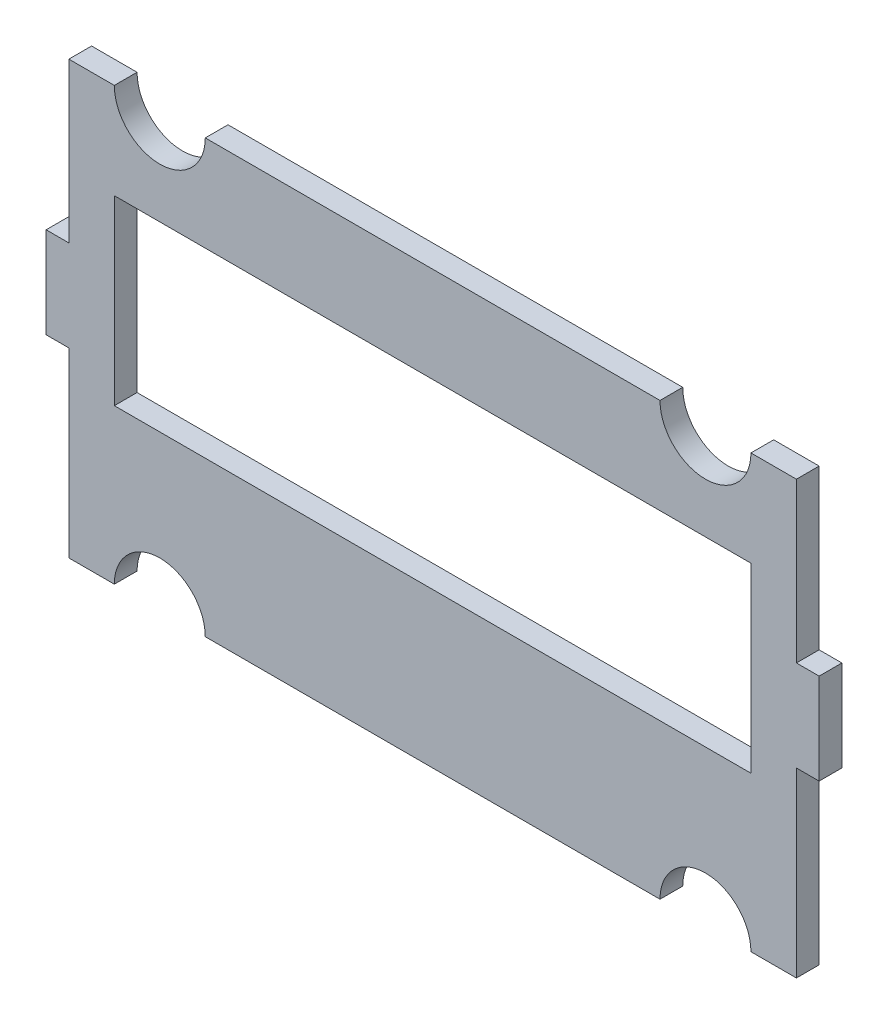
ISO-10303-21;
HEADER;
FILE_DESCRIPTION(('STEP AP214'),'2;1');
FILE_NAME('part.step','',(''),(''),'','','');
FILE_SCHEMA(('AUTOMOTIVE_DESIGN { 1 0 10303 214 1 1 1 1 }'));
ENDSEC;
DATA;
#1=APPLICATION_CONTEXT('core data for automotive mechanical design processes');
#2=APPLICATION_PROTOCOL_DEFINITION('international standard','automotive_design',2000,#1);
#3=PRODUCT_CONTEXT('',#1,'mechanical');
#4=PRODUCT('Part','Part','',(#3));
#5=PRODUCT_RELATED_PRODUCT_CATEGORY('part','',(#4));
#6=PRODUCT_DEFINITION_FORMATION('','',#4);
#7=PRODUCT_DEFINITION_CONTEXT('part definition',#1,'design');
#8=PRODUCT_DEFINITION('design','',#6,#7);
#9=PRODUCT_DEFINITION_SHAPE('','',#8);
#10=(LENGTH_UNIT() NAMED_UNIT(*) SI_UNIT(.MILLI.,.METRE.));
#11=(NAMED_UNIT(*) PLANE_ANGLE_UNIT() SI_UNIT($,.RADIAN.));
#12=(NAMED_UNIT(*) SI_UNIT($,.STERADIAN.) SOLID_ANGLE_UNIT());
#13=UNCERTAINTY_MEASURE_WITH_UNIT(LENGTH_MEASURE(1.E-05),#10,'distance_accuracy_value','');
#14=(GEOMETRIC_REPRESENTATION_CONTEXT(3) GLOBAL_UNCERTAINTY_ASSIGNED_CONTEXT((#13)) GLOBAL_UNIT_ASSIGNED_CONTEXT((#10,
#11,#12)) REPRESENTATION_CONTEXT('',''));
#15=CARTESIAN_POINT('',(0.,0.,0.));
#16=DIRECTION('',(0.,0.,1.));
#17=DIRECTION('',(1.,0.,0.));
#18=AXIS2_PLACEMENT_3D('',#15,#16,#17);
#19=CARTESIAN_POINT('',(0.,0.,3.175));
#20=DIRECTION('',(0.,1.,0.));
#21=DIRECTION('',(0.,0.,1.));
#22=AXIS2_PLACEMENT_3D('',#19,#20,#21);
#23=PLANE('',#22);
#24=DIRECTION('',(1.,0.,0.));
#25=VECTOR('',#24,1.);
#26=CARTESIAN_POINT('',(0.,0.,0.));
#27=LINE('',#26,#25);
#28=CARTESIAN_POINT('',(19.05,0.,0.));
#29=VERTEX_POINT('',#28);
#30=CARTESIAN_POINT('',(82.55,0.,0.));
#31=VERTEX_POINT('',#30);
#32=EDGE_CURVE('E393',#29,#31,#27,.T.);
#33=ORIENTED_EDGE('',*,*,#32,.T.);
#34=DIRECTION('',(0.,0.,1.));
#35=VECTOR('',#34,1.);
#36=CARTESIAN_POINT('',(82.55,0.,0.));
#37=LINE('',#36,#35);
#38=CARTESIAN_POINT('',(82.55,0.,3.175));
#39=VERTEX_POINT('',#38);
#40=EDGE_CURVE('E55',#31,#39,#37,.T.);
#41=ORIENTED_EDGE('',*,*,#40,.T.);
#42=DIRECTION('',(1.,0.,0.));
#43=VECTOR('',#42,1.);
#44=CARTESIAN_POINT('',(0.,0.,3.175));
#45=LINE('',#44,#43);
#46=CARTESIAN_POINT('',(19.05,0.,3.175));
#47=VERTEX_POINT('',#46);
#48=EDGE_CURVE('E379',#47,#39,#45,.T.);
#49=ORIENTED_EDGE('',*,*,#48,.F.);
#50=DIRECTION('',(0.,0.,1.));
#51=VECTOR('',#50,1.);
#52=CARTESIAN_POINT('',(19.05,0.,0.));
#53=LINE('',#52,#51);
#54=EDGE_CURVE('E425',#29,#47,#53,.T.);
#55=ORIENTED_EDGE('',*,*,#54,.F.);
#56=EDGE_LOOP('',(#33,#41,#49,#55));
#57=FACE_BOUND('',#56,.T.);
#58=ADVANCED_FACE('F39',(#57),#23,.F.);
#59=CARTESIAN_POINT('',(0.,0.,0.));
#60=VERTEX_POINT('',#59);
#61=CARTESIAN_POINT('',(6.35,0.,0.));
#62=VERTEX_POINT('',#61);
#63=EDGE_CURVE('E388',#60,#62,#27,.T.);
#64=ORIENTED_EDGE('',*,*,#63,.T.);
#65=DIRECTION('',(0.,0.,1.));
#66=VECTOR('',#65,1.);
#67=CARTESIAN_POINT('',(6.35,0.,0.));
#68=LINE('',#67,#66);
#69=CARTESIAN_POINT('',(6.35,0.,3.175));
#70=VERTEX_POINT('',#69);
#71=EDGE_CURVE('E63',#62,#70,#68,.T.);
#72=ORIENTED_EDGE('',*,*,#71,.T.);
#73=CARTESIAN_POINT('',(0.,0.,3.175));
#74=VERTEX_POINT('',#73);
#75=EDGE_CURVE('E374',#74,#70,#45,.T.);
#76=ORIENTED_EDGE('',*,*,#75,.F.);
#77=DIRECTION('',(0.,0.,-1.));
#78=VECTOR('',#77,1.);
#79=CARTESIAN_POINT('',(0.,0.,3.175));
#80=LINE('',#79,#78);
#81=EDGE_CURVE('E11',#74,#60,#80,.T.);
#82=ORIENTED_EDGE('',*,*,#81,.T.);
#83=EDGE_LOOP('',(#64,#72,#76,#82));
#84=FACE_BOUND('',#83,.T.);
#85=ADVANCED_FACE('F459',(#84),#23,.F.);
#86=CARTESIAN_POINT('',(0.,60.325,0.));
#87=DIRECTION('',(0.,-1.,0.));
#88=DIRECTION('',(0.,0.,-1.));
#89=AXIS2_PLACEMENT_3D('',#86,#87,#88);
#90=PLANE('',#89);
#91=DIRECTION('',(1.,0.,0.));
#92=VECTOR('',#91,1.);
#93=CARTESIAN_POINT('',(0.,60.325,0.));
#94=LINE('',#93,#92);
#95=CARTESIAN_POINT('',(19.05,60.325,0.));
#96=VERTEX_POINT('',#95);
#97=CARTESIAN_POINT('',(82.55,60.325,0.));
#98=VERTEX_POINT('',#97);
#99=EDGE_CURVE('E222',#96,#98,#94,.T.);
#100=ORIENTED_EDGE('',*,*,#99,.F.);
#101=DIRECTION('',(0.,0.,1.));
#102=VECTOR('',#101,1.);
#103=CARTESIAN_POINT('',(19.05,60.325,0.));
#104=LINE('',#103,#102);
#105=CARTESIAN_POINT('',(19.05,60.325,3.175));
#106=VERTEX_POINT('',#105);
#107=EDGE_CURVE('E440',#96,#106,#104,.T.);
#108=ORIENTED_EDGE('',*,*,#107,.T.);
#109=DIRECTION('',(1.,0.,0.));
#110=VECTOR('',#109,1.);
#111=CARTESIAN_POINT('',(0.,60.325,3.175));
#112=LINE('',#111,#110);
#113=CARTESIAN_POINT('',(82.55,60.325,3.175));
#114=VERTEX_POINT('',#113);
#115=EDGE_CURVE('E236',#106,#114,#112,.T.);
#116=ORIENTED_EDGE('',*,*,#115,.T.);
#117=DIRECTION('',(0.,0.,1.));
#118=VECTOR('',#117,1.);
#119=CARTESIAN_POINT('',(82.55,60.325,0.));
#120=LINE('',#119,#118);
#121=EDGE_CURVE('E211',#98,#114,#120,.T.);
#122=ORIENTED_EDGE('',*,*,#121,.F.);
#123=EDGE_LOOP('',(#100,#108,#116,#122));
#124=FACE_BOUND('',#123,.T.);
#125=ADVANCED_FACE('F491',(#124),#90,.F.);
#126=CARTESIAN_POINT('',(95.25,60.325,0.));
#127=VERTEX_POINT('',#126);
#128=CARTESIAN_POINT('',(101.6,60.325,0.));
#129=VERTEX_POINT('',#128);
#130=EDGE_CURVE('E218',#127,#129,#94,.T.);
#131=ORIENTED_EDGE('',*,*,#130,.F.);
#132=DIRECTION('',(0.,0.,1.));
#133=VECTOR('',#132,1.);
#134=CARTESIAN_POINT('',(95.25,60.325,0.));
#135=LINE('',#134,#133);
#136=CARTESIAN_POINT('',(95.25,60.325,3.175));
#137=VERTEX_POINT('',#136);
#138=EDGE_CURVE('E200',#127,#137,#135,.T.);
#139=ORIENTED_EDGE('',*,*,#138,.T.);
#140=CARTESIAN_POINT('',(101.6,60.325,3.175));
#141=VERTEX_POINT('',#140);
#142=EDGE_CURVE('E238',#137,#141,#112,.T.);
#143=ORIENTED_EDGE('',*,*,#142,.T.);
#144=DIRECTION('',(0.,0.,1.));
#145=VECTOR('',#144,1.);
#146=CARTESIAN_POINT('',(101.6,60.325,0.));
#147=LINE('',#146,#145);
#148=EDGE_CURVE('E227',#129,#141,#147,.T.);
#149=ORIENTED_EDGE('',*,*,#148,.F.);
#150=EDGE_LOOP('',(#131,#139,#143,#149));
#151=FACE_BOUND('',#150,.T.);
#152=ADVANCED_FACE('F225',(#151),#90,.F.);
#153=CARTESIAN_POINT('',(101.6,0.,3.175));
#154=DIRECTION('',(-1.,0.,0.));
#155=DIRECTION('',(0.,-1.,0.));
#156=AXIS2_PLACEMENT_3D('',#153,#154,#155);
#157=PLANE('',#156);
#158=DIRECTION('',(0.,1.,0.));
#159=VECTOR('',#158,1.);
#160=CARTESIAN_POINT('',(101.6,0.,0.));
#161=LINE('',#160,#159);
#162=CARTESIAN_POINT('',(101.6,38.1,0.));
#163=VERTEX_POINT('',#162);
#164=EDGE_CURVE('E392',#163,#129,#161,.T.);
#165=ORIENTED_EDGE('',*,*,#164,.T.);
#166=ORIENTED_EDGE('',*,*,#148,.T.);
#167=DIRECTION('',(0.,1.,0.));
#168=VECTOR('',#167,1.);
#169=CARTESIAN_POINT('',(101.6,0.,3.175));
#170=LINE('',#169,#168);
#171=CARTESIAN_POINT('',(101.6,38.1,3.175));
#172=VERTEX_POINT('',#171);
#173=EDGE_CURVE('E378',#172,#141,#170,.T.);
#174=ORIENTED_EDGE('',*,*,#173,.F.);
#175=DIRECTION('',(0.,0.,1.));
#176=VECTOR('',#175,1.);
#177=CARTESIAN_POINT('',(101.6,38.1,-13.0908603613361));
#178=LINE('',#177,#176);
#179=EDGE_CURVE('E272',#163,#172,#178,.T.);
#180=ORIENTED_EDGE('',*,*,#179,.F.);
#181=EDGE_LOOP('',(#165,#166,#174,#180));
#182=FACE_BOUND('',#181,.T.);
#183=ADVANCED_FACE('F498',(#182),#157,.F.);
#184=CARTESIAN_POINT('',(0.,0.,3.175));
#185=DIRECTION('',(1.,0.,0.));
#186=DIRECTION('',(0.,0.,-1.));
#187=AXIS2_PLACEMENT_3D('',#184,#185,#186);
#188=PLANE('',#187);
#189=DIRECTION('',(0.,0.,1.));
#190=VECTOR('',#189,1.);
#191=CARTESIAN_POINT('',(0.,25.4,-13.0908603613361));
#192=LINE('',#191,#190);
#193=CARTESIAN_POINT('',(0.,25.4,0.));
#194=VERTEX_POINT('',#193);
#195=CARTESIAN_POINT('',(0.,25.4,3.175));
#196=VERTEX_POINT('',#195);
#197=EDGE_CURVE('E308',#194,#196,#192,.T.);
#198=ORIENTED_EDGE('',*,*,#197,.F.);
#199=DIRECTION('',(0.,-1.,0.));
#200=VECTOR('',#199,1.);
#201=CARTESIAN_POINT('',(0.,0.,0.));
#202=LINE('',#201,#200);
#203=EDGE_CURVE('E359',#194,#60,#202,.T.);
#204=ORIENTED_EDGE('',*,*,#203,.T.);
#205=ORIENTED_EDGE('',*,*,#81,.F.);
#206=DIRECTION('',(0.,-1.,0.));
#207=VECTOR('',#206,1.);
#208=CARTESIAN_POINT('',(0.,0.,3.175));
#209=LINE('',#208,#207);
#210=EDGE_CURVE('E373',#196,#74,#209,.T.);
#211=ORIENTED_EDGE('',*,*,#210,.F.);
#212=EDGE_LOOP('',(#198,#204,#205,#211));
#213=FACE_BOUND('',#212,.T.);
#214=ADVANCED_FACE('F472',(#213),#188,.F.);
#215=CARTESIAN_POINT('',(0.,60.325,3.175));
#216=VERTEX_POINT('',#215);
#217=CARTESIAN_POINT('',(0.,38.1,3.175));
#218=VERTEX_POINT('',#217);
#219=EDGE_CURVE('E369',#216,#218,#209,.T.);
#220=ORIENTED_EDGE('',*,*,#219,.F.);
#221=DIRECTION('',(0.,0.,1.));
#222=VECTOR('',#221,1.);
#223=CARTESIAN_POINT('',(0.,60.325,0.));
#224=LINE('',#223,#222);
#225=CARTESIAN_POINT('',(0.,60.325,0.));
#226=VERTEX_POINT('',#225);
#227=EDGE_CURVE('E242',#226,#216,#224,.T.);
#228=ORIENTED_EDGE('',*,*,#227,.F.);
#229=CARTESIAN_POINT('',(0.,38.1,0.));
#230=VERTEX_POINT('',#229);
#231=EDGE_CURVE('E384',#226,#230,#202,.T.);
#232=ORIENTED_EDGE('',*,*,#231,.T.);
#233=DIRECTION('',(0.,0.,1.));
#234=VECTOR('',#233,1.);
#235=CARTESIAN_POINT('',(0.,38.1,-13.0908603613361));
#236=LINE('',#235,#234);
#237=EDGE_CURVE('E316',#230,#218,#236,.T.);
#238=ORIENTED_EDGE('',*,*,#237,.T.);
#239=EDGE_LOOP('',(#220,#228,#232,#238));
#240=FACE_BOUND('',#239,.T.);
#241=ADVANCED_FACE('F41',(#240),#188,.F.);
#242=CARTESIAN_POINT('',(95.25,0.,3.175));
#243=VERTEX_POINT('',#242);
#244=CARTESIAN_POINT('',(101.6,0.,3.175));
#245=VERTEX_POINT('',#244);
#246=EDGE_CURVE('E372',#243,#245,#45,.T.);
#247=ORIENTED_EDGE('',*,*,#246,.F.);
#248=DIRECTION('',(0.,0.,1.));
#249=VECTOR('',#248,1.);
#250=CARTESIAN_POINT('',(95.25,0.,0.));
#251=LINE('',#250,#249);
#252=CARTESIAN_POINT('',(95.25,0.,0.));
#253=VERTEX_POINT('',#252);
#254=EDGE_CURVE('E428',#253,#243,#251,.T.);
#255=ORIENTED_EDGE('',*,*,#254,.F.);
#256=CARTESIAN_POINT('',(101.6,0.,0.));
#257=VERTEX_POINT('',#256);
#258=EDGE_CURVE('E387',#253,#257,#27,.T.);
#259=ORIENTED_EDGE('',*,*,#258,.T.);
#260=DIRECTION('',(0.,0.,-1.));
#261=VECTOR('',#260,1.);
#262=CARTESIAN_POINT('',(101.6,0.,3.175));
#263=LINE('',#262,#261);
#264=EDGE_CURVE('E48',#245,#257,#263,.T.);
#265=ORIENTED_EDGE('',*,*,#264,.F.);
#266=EDGE_LOOP('',(#247,#255,#259,#265));
#267=FACE_BOUND('',#266,.T.);
#268=ADVANCED_FACE('F487',(#267),#23,.F.);
#269=CARTESIAN_POINT('',(101.6,25.4,0.));
#270=VERTEX_POINT('',#269);
#271=EDGE_CURVE('E394',#257,#270,#161,.T.);
#272=ORIENTED_EDGE('',*,*,#271,.T.);
#273=DIRECTION('',(0.,0.,1.));
#274=VECTOR('',#273,1.);
#275=CARTESIAN_POINT('',(101.6,25.4,-13.0908603613361));
#276=LINE('',#275,#274);
#277=CARTESIAN_POINT('',(101.6,25.4,3.175));
#278=VERTEX_POINT('',#277);
#279=EDGE_CURVE('E280',#270,#278,#276,.T.);
#280=ORIENTED_EDGE('',*,*,#279,.T.);
#281=EDGE_CURVE('E380',#245,#278,#170,.T.);
#282=ORIENTED_EDGE('',*,*,#281,.F.);
#283=ORIENTED_EDGE('',*,*,#264,.T.);
#284=EDGE_LOOP('',(#272,#280,#282,#283));
#285=FACE_BOUND('',#284,.T.);
#286=ADVANCED_FACE('F403',(#285),#157,.F.);
#287=CARTESIAN_POINT('',(0.,0.,3.175));
#288=DIRECTION('',(0.,0.,-1.));
#289=DIRECTION('',(-1.,0.,0.));
#290=AXIS2_PLACEMENT_3D('',#287,#288,#289);
#291=PLANE('',#290);
#292=DIRECTION('',(1.,0.,0.));
#293=VECTOR('',#292,1.);
#294=CARTESIAN_POINT('',(6.34999999999999,21.59,3.175));
#295=LINE('',#294,#293);
#296=CARTESIAN_POINT('',(6.34999999999999,21.59,3.175));
#297=VERTEX_POINT('',#296);
#298=CARTESIAN_POINT('',(95.25,21.59,3.175));
#299=VERTEX_POINT('',#298);
#300=EDGE_CURVE('E345',#297,#299,#295,.T.);
#301=ORIENTED_EDGE('',*,*,#300,.F.);
#302=DIRECTION('',(0.,-1.,0.));
#303=VECTOR('',#302,1.);
#304=CARTESIAN_POINT('',(6.34999999999997,46.99,3.175));
#305=LINE('',#304,#303);
#306=CARTESIAN_POINT('',(6.34999999999997,46.99,3.175));
#307=VERTEX_POINT('',#306);
#308=EDGE_CURVE('E324',#307,#297,#305,.T.);
#309=ORIENTED_EDGE('',*,*,#308,.F.);
#310=DIRECTION('',(-1.,0.,0.));
#311=VECTOR('',#310,1.);
#312=CARTESIAN_POINT('',(6.34999999999997,46.99,3.175));
#313=LINE('',#312,#311);
#314=CARTESIAN_POINT('',(95.25,46.99,3.175));
#315=VERTEX_POINT('',#314);
#316=EDGE_CURVE('E330',#315,#307,#313,.T.);
#317=ORIENTED_EDGE('',*,*,#316,.F.);
#318=DIRECTION('',(0.,1.,0.));
#319=VECTOR('',#318,1.);
#320=CARTESIAN_POINT('',(95.25,46.99,3.175));
#321=LINE('',#320,#319);
#322=EDGE_CURVE('E349',#299,#315,#321,.T.);
#323=ORIENTED_EDGE('',*,*,#322,.F.);
#324=EDGE_LOOP('',(#301,#309,#317,#323));
#325=FACE_BOUND('',#324,.T.);
#326=ORIENTED_EDGE('',*,*,#48,.T.);
#327=CARTESIAN_POINT('',(88.9,0.,3.175));
#328=DIRECTION('',(0.,0.,1.));
#329=DIRECTION('',(-1.,0.,0.));
#330=AXIS2_PLACEMENT_3D('',#327,#328,#329);
#331=CIRCLE('',#330,6.35);
#332=EDGE_CURVE('E415',#243,#39,#331,.T.);
#333=ORIENTED_EDGE('',*,*,#332,.F.);
#334=ORIENTED_EDGE('',*,*,#246,.T.);
#335=ORIENTED_EDGE('',*,*,#281,.T.);
#336=DIRECTION('',(1.,0.,0.));
#337=VECTOR('',#336,1.);
#338=CARTESIAN_POINT('',(101.6,25.4,3.175));
#339=LINE('',#338,#337);
#340=CARTESIAN_POINT('',(104.775,25.4,3.175));
#341=VERTEX_POINT('',#340);
#342=EDGE_CURVE('E250',#278,#341,#339,.T.);
#343=ORIENTED_EDGE('',*,*,#342,.T.);
#344=DIRECTION('',(0.,1.,0.));
#345=VECTOR('',#344,1.);
#346=CARTESIAN_POINT('',(104.775,38.1,3.175));
#347=LINE('',#346,#345);
#348=CARTESIAN_POINT('',(104.775,38.1,3.175));
#349=VERTEX_POINT('',#348);
#350=EDGE_CURVE('E258',#341,#349,#347,.T.);
#351=ORIENTED_EDGE('',*,*,#350,.T.);
#352=DIRECTION('',(-1.,0.,0.));
#353=VECTOR('',#352,1.);
#354=CARTESIAN_POINT('',(101.6,38.1,3.175));
#355=LINE('',#354,#353);
#356=EDGE_CURVE('E253',#349,#172,#355,.T.);
#357=ORIENTED_EDGE('',*,*,#356,.T.);
#358=ORIENTED_EDGE('',*,*,#173,.T.);
#359=ORIENTED_EDGE('',*,*,#142,.F.);
#360=CARTESIAN_POINT('',(88.9,60.325,3.175));
#361=DIRECTION('',(0.,0.,1.));
#362=DIRECTION('',(-1.,0.,0.));
#363=AXIS2_PLACEMENT_3D('',#360,#361,#362);
#364=CIRCLE('',#363,6.35);
#365=EDGE_CURVE('E206',#114,#137,#364,.T.);
#366=ORIENTED_EDGE('',*,*,#365,.F.);
#367=ORIENTED_EDGE('',*,*,#115,.F.);
#368=CARTESIAN_POINT('',(12.7,60.325,3.175));
#369=DIRECTION('',(0.,0.,1.));
#370=DIRECTION('',(1.,0.,0.));
#371=AXIS2_PLACEMENT_3D('',#368,#369,#370);
#372=CIRCLE('',#371,6.35);
#373=CARTESIAN_POINT('',(6.35,60.325,3.175));
#374=VERTEX_POINT('',#373);
#375=EDGE_CURVE('E441',#374,#106,#372,.T.);
#376=ORIENTED_EDGE('',*,*,#375,.F.);
#377=EDGE_CURVE('E230',#216,#374,#112,.T.);
#378=ORIENTED_EDGE('',*,*,#377,.F.);
#379=ORIENTED_EDGE('',*,*,#219,.T.);
#380=DIRECTION('',(-1.,0.,0.));
#381=VECTOR('',#380,1.);
#382=CARTESIAN_POINT('',(0.,38.1,3.175));
#383=LINE('',#382,#381);
#384=CARTESIAN_POINT('',(-3.175,38.1,3.175));
#385=VERTEX_POINT('',#384);
#386=EDGE_CURVE('E288',#218,#385,#383,.T.);
#387=ORIENTED_EDGE('',*,*,#386,.T.);
#388=DIRECTION('',(0.,-1.,0.));
#389=VECTOR('',#388,1.);
#390=CARTESIAN_POINT('',(-3.175,38.1,3.175));
#391=LINE('',#390,#389);
#392=CARTESIAN_POINT('',(-3.175,25.4,3.175));
#393=VERTEX_POINT('',#392);
#394=EDGE_CURVE('E294',#385,#393,#391,.T.);
#395=ORIENTED_EDGE('',*,*,#394,.T.);
#396=DIRECTION('',(1.,0.,0.));
#397=VECTOR('',#396,1.);
#398=CARTESIAN_POINT('',(0.,25.4,3.175));
#399=LINE('',#398,#397);
#400=EDGE_CURVE('E289',#393,#196,#399,.T.);
#401=ORIENTED_EDGE('',*,*,#400,.T.);
#402=ORIENTED_EDGE('',*,*,#210,.T.);
#403=ORIENTED_EDGE('',*,*,#75,.T.);
#404=CARTESIAN_POINT('',(12.7,0.,3.175));
#405=DIRECTION('',(0.,0.,1.));
#406=DIRECTION('',(1.,0.,0.));
#407=AXIS2_PLACEMENT_3D('',#404,#405,#406);
#408=CIRCLE('',#407,6.35);
#409=EDGE_CURVE('E421',#47,#70,#408,.T.);
#410=ORIENTED_EDGE('',*,*,#409,.F.);
#411=EDGE_LOOP('',(#326,#333,#334,#335,#343,#351,#357,#358,#359,#366,#367,#376,#378,#379,#387,
#395,#401,#402,#403,#410));
#412=FACE_BOUND('',#411,.T.);
#413=ADVANCED_FACE('F413',(#325,#412),#291,.F.);
#414=CARTESIAN_POINT('',(0.,0.,0.));
#415=DIRECTION('',(0.,0.,-1.));
#416=DIRECTION('',(-1.,0.,0.));
#417=AXIS2_PLACEMENT_3D('',#414,#415,#416);
#418=PLANE('',#417);
#419=CARTESIAN_POINT('',(88.9,0.,0.));
#420=DIRECTION('',(0.,0.,1.));
#421=DIRECTION('',(-1.,0.,0.));
#422=AXIS2_PLACEMENT_3D('',#419,#420,#421);
#423=CIRCLE('',#422,6.35);
#424=EDGE_CURVE('E429',#253,#31,#423,.T.);
#425=ORIENTED_EDGE('',*,*,#424,.T.);
#426=ORIENTED_EDGE('',*,*,#32,.F.);
#427=CARTESIAN_POINT('',(12.7,0.,0.));
#428=DIRECTION('',(0.,0.,1.));
#429=DIRECTION('',(1.,0.,0.));
#430=AXIS2_PLACEMENT_3D('',#427,#428,#429);
#431=CIRCLE('',#430,6.35);
#432=EDGE_CURVE('E450',#29,#62,#431,.T.);
#433=ORIENTED_EDGE('',*,*,#432,.T.);
#434=ORIENTED_EDGE('',*,*,#63,.F.);
#435=ORIENTED_EDGE('',*,*,#203,.F.);
#436=DIRECTION('',(1.,0.,0.));
#437=VECTOR('',#436,1.);
#438=CARTESIAN_POINT('',(0.,25.4,0.));
#439=LINE('',#438,#437);
#440=CARTESIAN_POINT('',(-3.175,25.4,0.));
#441=VERTEX_POINT('',#440);
#442=EDGE_CURVE('E305',#441,#194,#439,.T.);
#443=ORIENTED_EDGE('',*,*,#442,.F.);
#444=DIRECTION('',(0.,-1.,0.));
#445=VECTOR('',#444,1.);
#446=CARTESIAN_POINT('',(-3.175,38.1,0.));
#447=LINE('',#446,#445);
#448=CARTESIAN_POINT('',(-3.175,38.1,0.));
#449=VERTEX_POINT('',#448);
#450=EDGE_CURVE('E310',#449,#441,#447,.T.);
#451=ORIENTED_EDGE('',*,*,#450,.F.);
#452=DIRECTION('',(-1.,0.,0.));
#453=VECTOR('',#452,1.);
#454=CARTESIAN_POINT('',(0.,38.1,0.));
#455=LINE('',#454,#453);
#456=EDGE_CURVE('E293',#230,#449,#455,.T.);
#457=ORIENTED_EDGE('',*,*,#456,.F.);
#458=ORIENTED_EDGE('',*,*,#231,.F.);
#459=CARTESIAN_POINT('',(6.35,60.325,0.));
#460=VERTEX_POINT('',#459);
#461=EDGE_CURVE('E232',#226,#460,#94,.T.);
#462=ORIENTED_EDGE('',*,*,#461,.T.);
#463=CARTESIAN_POINT('',(12.7,60.325,0.));
#464=DIRECTION('',(0.,0.,1.));
#465=DIRECTION('',(1.,0.,0.));
#466=AXIS2_PLACEMENT_3D('',#463,#464,#465);
#467=CIRCLE('',#466,6.35);
#468=EDGE_CURVE('E437',#460,#96,#467,.T.);
#469=ORIENTED_EDGE('',*,*,#468,.T.);
#470=ORIENTED_EDGE('',*,*,#99,.T.);
#471=CARTESIAN_POINT('',(88.9,60.325,0.));
#472=DIRECTION('',(0.,0.,1.));
#473=DIRECTION('',(-1.,0.,0.));
#474=AXIS2_PLACEMENT_3D('',#471,#472,#473);
#475=CIRCLE('',#474,6.35);
#476=EDGE_CURVE('E203',#98,#127,#475,.T.);
#477=ORIENTED_EDGE('',*,*,#476,.T.);
#478=ORIENTED_EDGE('',*,*,#130,.T.);
#479=ORIENTED_EDGE('',*,*,#164,.F.);
#480=DIRECTION('',(-1.,0.,0.));
#481=VECTOR('',#480,1.);
#482=CARTESIAN_POINT('',(101.6,38.1,0.));
#483=LINE('',#482,#481);
#484=CARTESIAN_POINT('',(104.775,38.1,0.));
#485=VERTEX_POINT('',#484);
#486=EDGE_CURVE('E269',#485,#163,#483,.T.);
#487=ORIENTED_EDGE('',*,*,#486,.F.);
#488=DIRECTION('',(0.,1.,0.));
#489=VECTOR('',#488,1.);
#490=CARTESIAN_POINT('',(104.775,38.1,0.));
#491=LINE('',#490,#489);
#492=CARTESIAN_POINT('',(104.775,25.4,0.));
#493=VERTEX_POINT('',#492);
#494=EDGE_CURVE('E274',#493,#485,#491,.T.);
#495=ORIENTED_EDGE('',*,*,#494,.F.);
#496=DIRECTION('',(1.,0.,0.));
#497=VECTOR('',#496,1.);
#498=CARTESIAN_POINT('',(101.6,25.4,0.));
#499=LINE('',#498,#497);
#500=EDGE_CURVE('E257',#270,#493,#499,.T.);
#501=ORIENTED_EDGE('',*,*,#500,.F.);
#502=ORIENTED_EDGE('',*,*,#271,.F.);
#503=ORIENTED_EDGE('',*,*,#258,.F.);
#504=EDGE_LOOP('',(#425,#426,#433,#434,#435,#443,#451,#457,#458,#462,#469,#470,#477,#478,#479,
#487,#495,#501,#502,#503));
#505=FACE_BOUND('',#504,.T.);
#506=DIRECTION('',(0.,-1.,0.));
#507=VECTOR('',#506,1.);
#508=CARTESIAN_POINT('',(6.34999999999997,46.99,0.));
#509=LINE('',#508,#507);
#510=CARTESIAN_POINT('',(6.34999999999997,46.99,0.));
#511=VERTEX_POINT('',#510);
#512=CARTESIAN_POINT('',(6.34999999999999,21.59,0.));
#513=VERTEX_POINT('',#512);
#514=EDGE_CURVE('E325',#511,#513,#509,.T.);
#515=ORIENTED_EDGE('',*,*,#514,.T.);
#516=DIRECTION('',(1.,0.,0.));
#517=VECTOR('',#516,1.);
#518=CARTESIAN_POINT('',(6.34999999999999,21.59,0.));
#519=LINE('',#518,#517);
#520=CARTESIAN_POINT('',(95.25,21.59,0.));
#521=VERTEX_POINT('',#520);
#522=EDGE_CURVE('E329',#513,#521,#519,.T.);
#523=ORIENTED_EDGE('',*,*,#522,.T.);
#524=DIRECTION('',(0.,1.,0.));
#525=VECTOR('',#524,1.);
#526=CARTESIAN_POINT('',(95.25,46.99,0.));
#527=LINE('',#526,#525);
#528=CARTESIAN_POINT('',(95.25,46.99,0.));
#529=VERTEX_POINT('',#528);
#530=EDGE_CURVE('E334',#521,#529,#527,.T.);
#531=ORIENTED_EDGE('',*,*,#530,.T.);
#532=DIRECTION('',(-1.,0.,0.));
#533=VECTOR('',#532,1.);
#534=CARTESIAN_POINT('',(6.34999999999997,46.99,0.));
#535=LINE('',#534,#533);
#536=EDGE_CURVE('E338',#529,#511,#535,.T.);
#537=ORIENTED_EDGE('',*,*,#536,.T.);
#538=EDGE_LOOP('',(#515,#523,#531,#537));
#539=FACE_BOUND('',#538,.T.);
#540=ADVANCED_FACE('F215',(#505,#539),#418,.T.);
#541=CARTESIAN_POINT('',(6.34999999999997,46.99,0.));
#542=DIRECTION('',(-1.,0.,0.));
#543=DIRECTION('',(0.,-1.,0.));
#544=AXIS2_PLACEMENT_3D('',#541,#542,#543);
#545=PLANE('',#544);
#546=ORIENTED_EDGE('',*,*,#308,.T.);
#547=DIRECTION('',(0.,0.,1.));
#548=VECTOR('',#547,1.);
#549=CARTESIAN_POINT('',(6.34999999999999,21.59,0.));
#550=LINE('',#549,#548);
#551=EDGE_CURVE('E342',#513,#297,#550,.T.);
#552=ORIENTED_EDGE('',*,*,#551,.F.);
#553=ORIENTED_EDGE('',*,*,#514,.F.);
#554=DIRECTION('',(0.,0.,1.));
#555=VECTOR('',#554,1.);
#556=CARTESIAN_POINT('',(6.34999999999997,46.99,0.));
#557=LINE('',#556,#555);
#558=EDGE_CURVE('E356',#511,#307,#557,.T.);
#559=ORIENTED_EDGE('',*,*,#558,.T.);
#560=EDGE_LOOP('',(#546,#552,#553,#559));
#561=FACE_BOUND('',#560,.T.);
#562=ADVANCED_FACE('F535',(#561),#545,.F.);
#563=CARTESIAN_POINT('',(6.34999999999997,46.99,0.));
#564=DIRECTION('',(0.,1.,0.));
#565=DIRECTION('',(0.,0.,1.));
#566=AXIS2_PLACEMENT_3D('',#563,#564,#565);
#567=PLANE('',#566);
#568=ORIENTED_EDGE('',*,*,#316,.T.);
#569=ORIENTED_EDGE('',*,*,#558,.F.);
#570=ORIENTED_EDGE('',*,*,#536,.F.);
#571=DIRECTION('',(0.,0.,1.));
#572=VECTOR('',#571,1.);
#573=CARTESIAN_POINT('',(95.25,46.99,0.));
#574=LINE('',#573,#572);
#575=EDGE_CURVE('E360',#529,#315,#574,.T.);
#576=ORIENTED_EDGE('',*,*,#575,.T.);
#577=EDGE_LOOP('',(#568,#569,#570,#576));
#578=FACE_BOUND('',#577,.T.);
#579=ADVANCED_FACE('F531',(#578),#567,.F.);
#580=CARTESIAN_POINT('',(95.25,46.99,0.));
#581=DIRECTION('',(1.,0.,0.));
#582=DIRECTION('',(0.,1.,0.));
#583=AXIS2_PLACEMENT_3D('',#580,#581,#582);
#584=PLANE('',#583);
#585=ORIENTED_EDGE('',*,*,#322,.T.);
#586=ORIENTED_EDGE('',*,*,#575,.F.);
#587=ORIENTED_EDGE('',*,*,#530,.F.);
#588=DIRECTION('',(0.,0.,1.));
#589=VECTOR('',#588,1.);
#590=CARTESIAN_POINT('',(95.25,21.59,0.));
#591=LINE('',#590,#589);
#592=EDGE_CURVE('E363',#521,#299,#591,.T.);
#593=ORIENTED_EDGE('',*,*,#592,.T.);
#594=EDGE_LOOP('',(#585,#586,#587,#593));
#595=FACE_BOUND('',#594,.T.);
#596=ADVANCED_FACE('F534',(#595),#584,.F.);
#597=CARTESIAN_POINT('',(6.34999999999999,21.59,0.));
#598=DIRECTION('',(0.,-1.,0.));
#599=DIRECTION('',(0.,0.,-1.));
#600=AXIS2_PLACEMENT_3D('',#597,#598,#599);
#601=PLANE('',#600);
#602=ORIENTED_EDGE('',*,*,#300,.T.);
#603=ORIENTED_EDGE('',*,*,#592,.F.);
#604=ORIENTED_EDGE('',*,*,#522,.F.);
#605=ORIENTED_EDGE('',*,*,#551,.T.);
#606=EDGE_LOOP('',(#602,#603,#604,#605));
#607=FACE_BOUND('',#606,.T.);
#608=ADVANCED_FACE('F530',(#607),#601,.F.);
#609=CARTESIAN_POINT('',(0.,38.1,-13.0908603613361));
#610=DIRECTION('',(0.,1.,0.));
#611=DIRECTION('',(-1.,0.,0.));
#612=AXIS2_PLACEMENT_3D('',#609,#610,#611);
#613=PLANE('',#612);
#614=ORIENTED_EDGE('',*,*,#237,.F.);
#615=ORIENTED_EDGE('',*,*,#456,.T.);
#616=DIRECTION('',(0.,0.,1.));
#617=VECTOR('',#616,1.);
#618=CARTESIAN_POINT('',(-3.175,38.1,-13.0908603613361));
#619=LINE('',#618,#617);
#620=EDGE_CURVE('E304',#449,#385,#619,.T.);
#621=ORIENTED_EDGE('',*,*,#620,.T.);
#622=ORIENTED_EDGE('',*,*,#386,.F.);
#623=EDGE_LOOP('',(#614,#615,#621,#622));
#624=FACE_BOUND('',#623,.T.);
#625=ADVANCED_FACE('F508',(#624),#613,.T.);
#626=CARTESIAN_POINT('',(-3.175,38.1,-13.0908603613361));
#627=DIRECTION('',(-1.,0.,0.));
#628=DIRECTION('',(0.,0.,1.));
#629=AXIS2_PLACEMENT_3D('',#626,#627,#628);
#630=PLANE('',#629);
#631=ORIENTED_EDGE('',*,*,#620,.F.);
#632=ORIENTED_EDGE('',*,*,#450,.T.);
#633=DIRECTION('',(0.,0.,1.));
#634=VECTOR('',#633,1.);
#635=CARTESIAN_POINT('',(-3.175,25.4,-13.0908603613361));
#636=LINE('',#635,#634);
#637=EDGE_CURVE('E309',#441,#393,#636,.T.);
#638=ORIENTED_EDGE('',*,*,#637,.T.);
#639=ORIENTED_EDGE('',*,*,#394,.F.);
#640=EDGE_LOOP('',(#631,#632,#638,#639));
#641=FACE_BOUND('',#640,.T.);
#642=ADVANCED_FACE('F513',(#641),#630,.T.);
#643=CARTESIAN_POINT('',(0.,25.4,-13.0908603613361));
#644=DIRECTION('',(0.,-1.,0.));
#645=DIRECTION('',(0.,0.,-1.));
#646=AXIS2_PLACEMENT_3D('',#643,#644,#645);
#647=PLANE('',#646);
#648=ORIENTED_EDGE('',*,*,#637,.F.);
#649=ORIENTED_EDGE('',*,*,#442,.T.);
#650=ORIENTED_EDGE('',*,*,#197,.T.);
#651=ORIENTED_EDGE('',*,*,#400,.F.);
#652=EDGE_LOOP('',(#648,#649,#650,#651));
#653=FACE_BOUND('',#652,.T.);
#654=ADVANCED_FACE('F516',(#653),#647,.T.);
#655=CARTESIAN_POINT('',(101.6,25.4,-13.0908603613361));
#656=DIRECTION('',(0.,-1.,0.));
#657=DIRECTION('',(0.,0.,-1.));
#658=AXIS2_PLACEMENT_3D('',#655,#656,#657);
#659=PLANE('',#658);
#660=ORIENTED_EDGE('',*,*,#279,.F.);
#661=ORIENTED_EDGE('',*,*,#500,.T.);
#662=DIRECTION('',(0.,0.,1.));
#663=VECTOR('',#662,1.);
#664=CARTESIAN_POINT('',(104.775,25.4,-13.0908603613361));
#665=LINE('',#664,#663);
#666=EDGE_CURVE('E268',#493,#341,#665,.T.);
#667=ORIENTED_EDGE('',*,*,#666,.T.);
#668=ORIENTED_EDGE('',*,*,#342,.F.);
#669=EDGE_LOOP('',(#660,#661,#667,#668));
#670=FACE_BOUND('',#669,.T.);
#671=ADVANCED_FACE('F410',(#670),#659,.T.);
#672=CARTESIAN_POINT('',(104.775,38.1,-13.0908603613361));
#673=DIRECTION('',(1.,0.,0.));
#674=DIRECTION('',(0.,0.,-1.));
#675=AXIS2_PLACEMENT_3D('',#672,#673,#674);
#676=PLANE('',#675);
#677=ORIENTED_EDGE('',*,*,#666,.F.);
#678=ORIENTED_EDGE('',*,*,#494,.T.);
#679=DIRECTION('',(0.,0.,1.));
#680=VECTOR('',#679,1.);
#681=CARTESIAN_POINT('',(104.775,38.1,-13.0908603613361));
#682=LINE('',#681,#680);
#683=EDGE_CURVE('E273',#485,#349,#682,.T.);
#684=ORIENTED_EDGE('',*,*,#683,.T.);
#685=ORIENTED_EDGE('',*,*,#350,.F.);
#686=EDGE_LOOP('',(#677,#678,#684,#685));
#687=FACE_BOUND('',#686,.T.);
#688=ADVANCED_FACE('F523',(#687),#676,.T.);
#689=CARTESIAN_POINT('',(101.6,38.1,-13.0908603613361));
#690=DIRECTION('',(0.,1.,0.));
#691=DIRECTION('',(-1.,0.,0.));
#692=AXIS2_PLACEMENT_3D('',#689,#690,#691);
#693=PLANE('',#692);
#694=ORIENTED_EDGE('',*,*,#683,.F.);
#695=ORIENTED_EDGE('',*,*,#486,.T.);
#696=ORIENTED_EDGE('',*,*,#179,.T.);
#697=ORIENTED_EDGE('',*,*,#356,.F.);
#698=EDGE_LOOP('',(#694,#695,#696,#697));
#699=FACE_BOUND('',#698,.T.);
#700=ADVANCED_FACE('F600',(#699),#693,.T.);
#701=ORIENTED_EDGE('',*,*,#377,.T.);
#702=DIRECTION('',(0.,0.,1.));
#703=VECTOR('',#702,1.);
#704=CARTESIAN_POINT('',(6.35,60.325,0.));
#705=LINE('',#704,#703);
#706=EDGE_CURVE('E444',#460,#374,#705,.T.);
#707=ORIENTED_EDGE('',*,*,#706,.F.);
#708=ORIENTED_EDGE('',*,*,#461,.F.);
#709=ORIENTED_EDGE('',*,*,#227,.T.);
#710=EDGE_LOOP('',(#701,#707,#708,#709));
#711=FACE_BOUND('',#710,.T.);
#712=ADVANCED_FACE('F609',(#711),#90,.F.);
#713=CARTESIAN_POINT('',(88.9,60.325,0.));
#714=DIRECTION('',(0.,0.,1.));
#715=DIRECTION('',(1.,0.,0.));
#716=AXIS2_PLACEMENT_3D('',#713,#714,#715);
#717=CYLINDRICAL_SURFACE('',#716,6.35);
#718=ORIENTED_EDGE('',*,*,#365,.T.);
#719=ORIENTED_EDGE('',*,*,#138,.F.);
#720=ORIENTED_EDGE('',*,*,#476,.F.);
#721=ORIENTED_EDGE('',*,*,#121,.T.);
#722=EDGE_LOOP('',(#718,#719,#720,#721));
#723=FACE_BOUND('',#722,.T.);
#724=ADVANCED_FACE('F202',(#723),#717,.F.);
#725=CARTESIAN_POINT('',(12.7,60.325,0.));
#726=DIRECTION('',(0.,0.,1.));
#727=DIRECTION('',(1.,0.,0.));
#728=AXIS2_PLACEMENT_3D('',#725,#726,#727);
#729=CYLINDRICAL_SURFACE('',#728,6.35);
#730=ORIENTED_EDGE('',*,*,#375,.T.);
#731=ORIENTED_EDGE('',*,*,#107,.F.);
#732=ORIENTED_EDGE('',*,*,#468,.F.);
#733=ORIENTED_EDGE('',*,*,#706,.T.);
#734=EDGE_LOOP('',(#730,#731,#732,#733));
#735=FACE_BOUND('',#734,.T.);
#736=ADVANCED_FACE('F476',(#735),#729,.F.);
#737=CARTESIAN_POINT('',(12.7,0.,0.));
#738=DIRECTION('',(0.,0.,1.));
#739=DIRECTION('',(1.,0.,0.));
#740=AXIS2_PLACEMENT_3D('',#737,#738,#739);
#741=CYLINDRICAL_SURFACE('',#740,6.35);
#742=ORIENTED_EDGE('',*,*,#409,.T.);
#743=ORIENTED_EDGE('',*,*,#71,.F.);
#744=ORIENTED_EDGE('',*,*,#432,.F.);
#745=ORIENTED_EDGE('',*,*,#54,.T.);
#746=EDGE_LOOP('',(#742,#743,#744,#745));
#747=FACE_BOUND('',#746,.T.);
#748=ADVANCED_FACE('F473',(#747),#741,.F.);
#749=CARTESIAN_POINT('',(88.9,0.,0.));
#750=DIRECTION('',(0.,0.,1.));
#751=DIRECTION('',(1.,0.,0.));
#752=AXIS2_PLACEMENT_3D('',#749,#750,#751);
#753=CYLINDRICAL_SURFACE('',#752,6.35);
#754=ORIENTED_EDGE('',*,*,#332,.T.);
#755=ORIENTED_EDGE('',*,*,#40,.F.);
#756=ORIENTED_EDGE('',*,*,#424,.F.);
#757=ORIENTED_EDGE('',*,*,#254,.T.);
#758=EDGE_LOOP('',(#754,#755,#756,#757));
#759=FACE_BOUND('',#758,.T.);
#760=ADVANCED_FACE('F475',(#759),#753,.F.);
#761=CLOSED_SHELL('',(#58,#85,#125,#152,#183,#214,#241,#268,#286,#413,#540,#562,#579,#596,#608,
#625,#642,#654,#671,#688,#700,#712,#724,#736,#748,#760));
#762=MANIFOLD_SOLID_BREP('B2',#761);
#763=ADVANCED_BREP_SHAPE_REPRESENTATION('',(#18,#762),#14);
#764=SHAPE_DEFINITION_REPRESENTATION(#9,#763);
ENDSEC;
END-ISO-10303-21;
